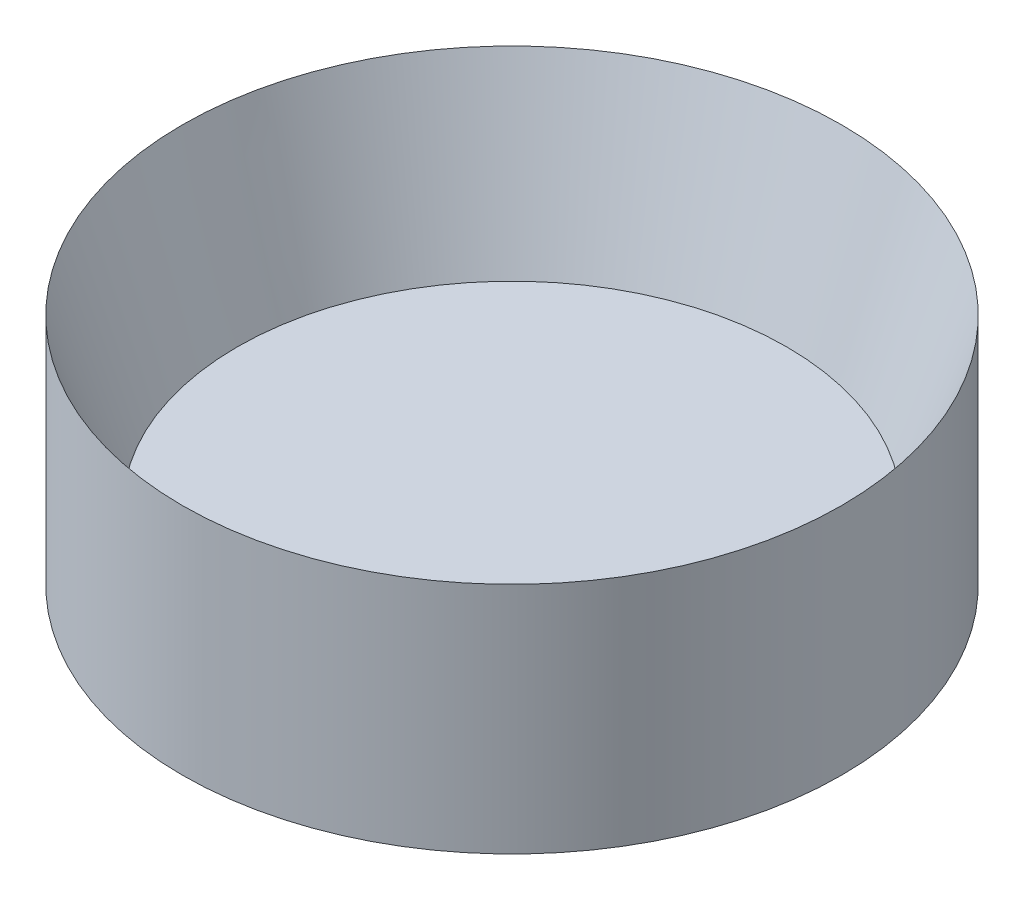
ISO-10303-21;
HEADER;
FILE_DESCRIPTION(('STEP AP214'),'2;1');
FILE_NAME('part.step','',(''),(''),'','','');
FILE_SCHEMA(('AUTOMOTIVE_DESIGN { 1 0 10303 214 1 1 1 1 }'));
ENDSEC;
DATA;
#1=APPLICATION_CONTEXT('core data for automotive mechanical design processes');
#2=APPLICATION_PROTOCOL_DEFINITION('international standard','automotive_design',2000,#1);
#3=PRODUCT_CONTEXT('',#1,'mechanical');
#4=PRODUCT('Part','Part','',(#3));
#5=PRODUCT_RELATED_PRODUCT_CATEGORY('part','',(#4));
#6=PRODUCT_DEFINITION_FORMATION('','',#4);
#7=PRODUCT_DEFINITION_CONTEXT('part definition',#1,'design');
#8=PRODUCT_DEFINITION('design','',#6,#7);
#9=PRODUCT_DEFINITION_SHAPE('','',#8);
#10=(LENGTH_UNIT() NAMED_UNIT(*) SI_UNIT(.MILLI.,.METRE.));
#11=(NAMED_UNIT(*) PLANE_ANGLE_UNIT() SI_UNIT($,.RADIAN.));
#12=(NAMED_UNIT(*) SI_UNIT($,.STERADIAN.) SOLID_ANGLE_UNIT());
#13=UNCERTAINTY_MEASURE_WITH_UNIT(LENGTH_MEASURE(1.E-05),#10,'distance_accuracy_value','');
#14=(GEOMETRIC_REPRESENTATION_CONTEXT(3) GLOBAL_UNCERTAINTY_ASSIGNED_CONTEXT((#13)) GLOBAL_UNIT_ASSIGNED_CONTEXT((#10,
#11,#12)) REPRESENTATION_CONTEXT('',''));
#15=CARTESIAN_POINT('',(0.,0.,0.));
#16=DIRECTION('',(0.,0.,1.));
#17=DIRECTION('',(1.,0.,0.));
#18=AXIS2_PLACEMENT_3D('',#15,#16,#17);
#19=CARTESIAN_POINT('',(-72.39499366416,-2.676384400526,-46.24331973759));
#20=DIRECTION('',(0.,-1.,0.));
#21=DIRECTION('',(0.,0.,-1.));
#22=AXIS2_PLACEMENT_3D('',#19,#20,#21);
#23=PLANE('',#22);
#24=CARTESIAN_POINT('',(-76.0399936642,-2.67638440050177,-46.24331973764));
#25=DIRECTION('',(0.,1.,0.));
#26=DIRECTION('',(0.,0.,1.));
#27=AXIS2_PLACEMENT_3D('',#24,#25,#26);
#28=CIRCLE('',#27,0.200000000052725);
#29=CARTESIAN_POINT('',(-76.0399936642,-2.67638440050177,-46.0433197375873));
#30=VERTEX_POINT('',#29);
#31=EDGE_CURVE('E17',#30,#30,#28,.T.);
#32=ORIENTED_EDGE('',*,*,#31,.T.);
#33=EDGE_LOOP('',(#32));
#34=FACE_BOUND('',#33,.T.);
#35=ADVANCED_FACE('F14',(#34),#23,.F.);
#36=CARTESIAN_POINT('',(-76.0399936642,-2.55638440063422,-46.24331973764));
#37=DIRECTION('',(0.,1.,0.));
#38=DIRECTION('',(0.,0.,1.));
#39=AXIS2_PLACEMENT_3D('',#36,#37,#38);
#40=CONICAL_SURFACE('',#39,0.240000000018052,0.321750554467696);
#41=ORIENTED_EDGE('',*,*,#31,.F.);
#42=EDGE_LOOP('',(#41));
#43=FACE_BOUND('',#42,.T.);
#44=CARTESIAN_POINT('',(-76.0399936642,-2.556384400581,-46.24331973764));
#45=DIRECTION('',(0.,1.,0.));
#46=DIRECTION('',(0.,0.,1.));
#47=AXIS2_PLACEMENT_3D('',#44,#45,#46);
#48=CIRCLE('',#47,0.24);
#49=CARTESIAN_POINT('',(-76.0399936642,-2.556384400581,-46.00331973764));
#50=VERTEX_POINT('',#49);
#51=EDGE_CURVE('E21',#50,#50,#48,.F.);
#52=ORIENTED_EDGE('',*,*,#51,.F.);
#53=EDGE_LOOP('',(#52));
#54=FACE_BOUND('',#53,.T.);
#55=ADVANCED_FACE('F32',(#43,#54),#40,.F.);
#56=CARTESIAN_POINT('',(-76.0399936642,-2.126384400507,-46.24331973764));
#57=DIRECTION('',(0.,1.,0.));
#58=DIRECTION('',(0.,0.,1.));
#59=AXIS2_PLACEMENT_3D('',#56,#57,#58);
#60=CYLINDRICAL_SURFACE('',#59,0.24);
#61=ORIENTED_EDGE('',*,*,#51,.T.);
#62=EDGE_LOOP('',(#61));
#63=FACE_BOUND('',#62,.T.);
#64=CARTESIAN_POINT('',(-76.0399936642,-2.726384400507,-46.24331973764));
#65=DIRECTION('',(0.,1.,0.));
#66=DIRECTION('',(0.,0.,1.));
#67=AXIS2_PLACEMENT_3D('',#64,#65,#66);
#68=CIRCLE('',#67,0.24);
#69=CARTESIAN_POINT('',(-76.0399936642,-2.726384400507,-46.00331973764));
#70=VERTEX_POINT('',#69);
#71=EDGE_CURVE('E10',#70,#70,#68,.T.);
#72=ORIENTED_EDGE('',*,*,#71,.T.);
#73=EDGE_LOOP('',(#72));
#74=FACE_BOUND('',#73,.T.);
#75=ADVANCED_FACE('F35',(#63,#74),#60,.T.);
#76=CARTESIAN_POINT('',(-72.39501409646,-2.726384400507,-41.29331973764));
#77=DIRECTION('',(0.,1.,0.));
#78=DIRECTION('',(0.,0.,1.));
#79=AXIS2_PLACEMENT_3D('',#76,#77,#78);
#80=PLANE('',#79);
#81=ORIENTED_EDGE('',*,*,#71,.F.);
#82=EDGE_LOOP('',(#81));
#83=FACE_BOUND('',#82,.T.);
#84=ADVANCED_FACE('F41',(#83),#80,.F.);
#85=CLOSED_SHELL('',(#35,#55,#75,#84));
#86=MANIFOLD_SOLID_BREP('B1',#85);
#87=ADVANCED_BREP_SHAPE_REPRESENTATION('',(#18,#86),#14);
#88=SHAPE_DEFINITION_REPRESENTATION(#9,#87);
ENDSEC;
END-ISO-10303-21;
